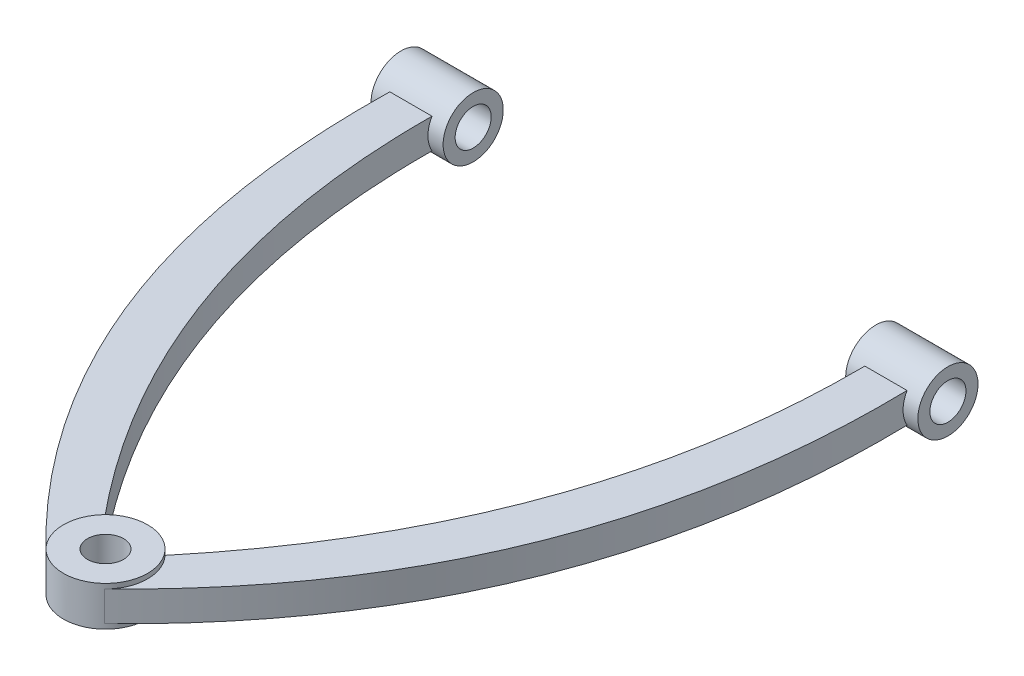
ISO-10303-21;
HEADER;
FILE_DESCRIPTION(('STEP AP214'),'2;1');
FILE_NAME('part.step','',(''),(''),'','','');
FILE_SCHEMA(('AUTOMOTIVE_DESIGN { 1 0 10303 214 1 1 1 1 }'));
ENDSEC;
DATA;
#1=APPLICATION_CONTEXT('core data for automotive mechanical design processes');
#2=APPLICATION_PROTOCOL_DEFINITION('international standard','automotive_design',2000,#1);
#3=PRODUCT_CONTEXT('',#1,'mechanical');
#4=PRODUCT('Part','Part','',(#3));
#5=PRODUCT_RELATED_PRODUCT_CATEGORY('part','',(#4));
#6=PRODUCT_DEFINITION_FORMATION('','',#4);
#7=PRODUCT_DEFINITION_CONTEXT('part definition',#1,'design');
#8=PRODUCT_DEFINITION('design','',#6,#7);
#9=PRODUCT_DEFINITION_SHAPE('','',#8);
#10=(LENGTH_UNIT() NAMED_UNIT(*) SI_UNIT(.MILLI.,.METRE.));
#11=(NAMED_UNIT(*) PLANE_ANGLE_UNIT() SI_UNIT($,.RADIAN.));
#12=(NAMED_UNIT(*) SI_UNIT($,.STERADIAN.) SOLID_ANGLE_UNIT());
#13=UNCERTAINTY_MEASURE_WITH_UNIT(LENGTH_MEASURE(1.E-05),#10,'distance_accuracy_value','');
#14=(GEOMETRIC_REPRESENTATION_CONTEXT(3) GLOBAL_UNCERTAINTY_ASSIGNED_CONTEXT((#13)) GLOBAL_UNIT_ASSIGNED_CONTEXT((#10,
#11,#12)) REPRESENTATION_CONTEXT('',''));
#15=CARTESIAN_POINT('',(0.,0.,0.));
#16=DIRECTION('',(0.,0.,1.));
#17=DIRECTION('',(1.,0.,0.));
#18=AXIS2_PLACEMENT_3D('',#15,#16,#17);
#19=CARTESIAN_POINT('',(85.6927414904811,0.,-95.6897984704443));
#20=DIRECTION('',(0.,1.,0.));
#21=DIRECTION('',(0.,0.,1.));
#22=AXIS2_PLACEMENT_3D('',#19,#20,#21);
#23=PLANE('',#22);
#24=CARTESIAN_POINT('',(0.,0.,0.));
#25=DIRECTION('',(0.,-1.,0.));
#26=DIRECTION('',(0.,0.,-1.));
#27=AXIS2_PLACEMENT_3D('',#24,#25,#26);
#28=CIRCLE('',#27,17.5);
#29=CARTESIAN_POINT('',(-12.1391438354918,0.,12.605204756022));
#30=VERTEX_POINT('',#29);
#31=CARTESIAN_POINT('',(-12.647886897628,0.,-12.094666469763));
#32=VERTEX_POINT('',#31);
#33=EDGE_CURVE('E125',#30,#32,#28,.T.);
#34=ORIENTED_EDGE('',*,*,#33,.F.);
#35=CARTESIAN_POINT('',(-107.423550962357,0.,-229.));
#36=CARTESIAN_POINT('',(-111.604135582139,0.,-83.1821993187942));
#37=CARTESIAN_POINT('',(-12.1391438352886,0.,12.605204755811));
#38=B_SPLINE_CURVE_WITH_KNOTS('',2,(#35,#36,#37),.UNSPECIFIED.,.F.,.F.,(3,3),(0.,1.),.UNSPECIFIED.);
#39=CARTESIAN_POINT('',(-107.505546569178,0.,-225.674682452694));
#40=VERTEX_POINT('',#39);
#41=EDGE_CURVE('E178',#40,#30,#38,.T.);
#42=ORIENTED_EDGE('',*,*,#41,.F.);
#43=DIRECTION('',(1.,0.,0.));
#44=VECTOR('',#43,1.);
#45=CARTESIAN_POINT('',(-113.673550962359,0.,-225.674682452694));
#46=LINE('',#45,#44);
#47=CARTESIAN_POINT('',(-89.965946252667,0.,-225.674682452695));
#48=VERTEX_POINT('',#47);
#49=EDGE_CURVE('E64',#40,#48,#46,.T.);
#50=ORIENTED_EDGE('',*,*,#49,.T.);
#51=CARTESIAN_POINT('',(-12.647886897628,0.,-12.094666469763));
#52=CARTESIAN_POINT('',(-92.0272334008473,0.,-107.676295976017));
#53=CARTESIAN_POINT('',(-89.9235509623574,0.,-229.));
#54=B_SPLINE_CURVE_WITH_KNOTS('',2,(#51,#52,#53),.UNSPECIFIED.,.F.,.F.,(3,3),(0.,1.),.UNSPECIFIED.);
#55=EDGE_CURVE('E133',#32,#48,#54,.T.);
#56=ORIENTED_EDGE('',*,*,#55,.F.);
#57=EDGE_LOOP('',(#34,#42,#50,#56));
#58=FACE_BOUND('',#57,.T.);
#59=ADVANCED_FACE('F41',(#58),#23,.F.);
#60=CARTESIAN_POINT('',(12.6478868978345,0.,-12.0946664699605));
#61=VERTEX_POINT('',#60);
#62=CARTESIAN_POINT('',(12.1391438354918,0.,12.605204756022));
#63=VERTEX_POINT('',#62);
#64=EDGE_CURVE('E114',#61,#63,#28,.T.);
#65=ORIENTED_EDGE('',*,*,#64,.F.);
#66=CARTESIAN_POINT('',(89.9235509623574,0.,-229.));
#67=CARTESIAN_POINT('',(92.0272334008473,0.,-107.676295976017));
#68=CARTESIAN_POINT('',(12.647886897628,0.,-12.094666469763));
#69=B_SPLINE_CURVE_WITH_KNOTS('',2,(#66,#67,#68),.UNSPECIFIED.,.F.,.F.,(3,3),(0.,1.),.UNSPECIFIED.);
#70=CARTESIAN_POINT('',(89.9659462526292,0.,-225.674682452695));
#71=VERTEX_POINT('',#70);
#72=EDGE_CURVE('E117',#71,#61,#69,.T.);
#73=ORIENTED_EDGE('',*,*,#72,.F.);
#74=DIRECTION('',(-1.,0.,0.));
#75=VECTOR('',#74,1.);
#76=CARTESIAN_POINT('',(113.673550962359,0.,-225.674682452694));
#77=LINE('',#76,#75);
#78=CARTESIAN_POINT('',(107.505546569178,0.,-225.674682452694));
#79=VERTEX_POINT('',#78);
#80=EDGE_CURVE('E296',#79,#71,#77,.T.);
#81=ORIENTED_EDGE('',*,*,#80,.F.);
#82=CARTESIAN_POINT('',(12.1391438352886,0.,12.605204755811));
#83=CARTESIAN_POINT('',(111.604135582139,0.,-83.1821993187942));
#84=CARTESIAN_POINT('',(107.423550962357,0.,-229.));
#85=B_SPLINE_CURVE_WITH_KNOTS('',2,(#82,#83,#84),.UNSPECIFIED.,.F.,.F.,(3,3),(0.,1.),.UNSPECIFIED.);
#86=EDGE_CURVE('E119',#63,#79,#85,.T.);
#87=ORIENTED_EDGE('',*,*,#86,.F.);
#88=EDGE_LOOP('',(#65,#73,#81,#87));
#89=FACE_BOUND('',#88,.T.);
#90=ADVANCED_FACE('F116',(#89),#23,.F.);
#91=CARTESIAN_POINT('',(85.6927414904811,12.5,-95.6897984704443));
#92=DIRECTION('',(0.,1.,0.));
#93=DIRECTION('',(0.,0.,1.));
#94=AXIS2_PLACEMENT_3D('',#91,#92,#93);
#95=PLANE('',#94);
#96=CARTESIAN_POINT('',(-107.423550962357,12.5,-229.));
#97=CARTESIAN_POINT('',(-111.604135582139,12.5,-83.1821993187942));
#98=CARTESIAN_POINT('',(-12.1391438352886,12.5,12.605204755811));
#99=B_SPLINE_CURVE_WITH_KNOTS('',2,(#96,#97,#98),.UNSPECIFIED.,.F.,.F.,(3,3),(0.,1.),.UNSPECIFIED.);
#100=CARTESIAN_POINT('',(-107.505546569178,12.5,-225.674682452694));
#101=VERTEX_POINT('',#100);
#102=CARTESIAN_POINT('',(-12.1391438352886,12.5,12.605204755811));
#103=VERTEX_POINT('',#102);
#104=EDGE_CURVE('E195',#101,#103,#99,.T.);
#105=ORIENTED_EDGE('',*,*,#104,.T.);
#106=CARTESIAN_POINT('',(0.,12.5,0.));
#107=DIRECTION('',(0.,1.,0.));
#108=DIRECTION('',(0.,0.,1.));
#109=AXIS2_PLACEMENT_3D('',#106,#107,#108);
#110=CIRCLE('',#109,17.5);
#111=CARTESIAN_POINT('',(-12.647886897628,12.5,-12.094666469763));
#112=VERTEX_POINT('',#111);
#113=EDGE_CURVE('E315',#112,#103,#110,.T.);
#114=ORIENTED_EDGE('',*,*,#113,.F.);
#115=CARTESIAN_POINT('',(-12.647886897628,12.5,-12.094666469763));
#116=CARTESIAN_POINT('',(-92.0272334008473,12.5,-107.676295976017));
#117=CARTESIAN_POINT('',(-89.9235509623574,12.5,-229.));
#118=B_SPLINE_CURVE_WITH_KNOTS('',2,(#115,#116,#117),.UNSPECIFIED.,.F.,.F.,(3,3),(0.,1.),.UNSPECIFIED.);
#119=CARTESIAN_POINT('',(-89.965946252667,12.5,-225.674682452695));
#120=VERTEX_POINT('',#119);
#121=EDGE_CURVE('E186',#112,#120,#118,.T.);
#122=ORIENTED_EDGE('',*,*,#121,.T.);
#123=DIRECTION('',(1.,0.,0.));
#124=VECTOR('',#123,1.);
#125=CARTESIAN_POINT('',(-113.673550962359,12.5,-225.674682452694));
#126=LINE('',#125,#124);
#127=EDGE_CURVE('E220',#101,#120,#126,.T.);
#128=ORIENTED_EDGE('',*,*,#127,.F.);
#129=EDGE_LOOP('',(#105,#114,#122,#128));
#130=FACE_BOUND('',#129,.T.);
#131=ADVANCED_FACE('F251',(#130),#95,.T.);
#132=CARTESIAN_POINT('',(89.9235509623574,12.5,-229.));
#133=CARTESIAN_POINT('',(92.0272334008473,12.5,-107.676295976017));
#134=CARTESIAN_POINT('',(12.647886897628,12.5,-12.094666469763));
#135=B_SPLINE_CURVE_WITH_KNOTS('',2,(#132,#133,#134),.UNSPECIFIED.,.F.,.F.,(3,3),(0.,1.),.UNSPECIFIED.);
#136=CARTESIAN_POINT('',(89.9659462526292,12.5,-225.674682452695));
#137=VERTEX_POINT('',#136);
#138=CARTESIAN_POINT('',(12.647886897628,12.5,-12.094666469763));
#139=VERTEX_POINT('',#138);
#140=EDGE_CURVE('E177',#137,#139,#135,.T.);
#141=ORIENTED_EDGE('',*,*,#140,.T.);
#142=CARTESIAN_POINT('',(12.1391438354918,12.5,12.605204756022));
#143=VERTEX_POINT('',#142);
#144=EDGE_CURVE('E138',#143,#139,#110,.T.);
#145=ORIENTED_EDGE('',*,*,#144,.F.);
#146=CARTESIAN_POINT('',(12.1391438352886,12.5,12.605204755811));
#147=CARTESIAN_POINT('',(111.604135582139,12.5,-83.1821993187942));
#148=CARTESIAN_POINT('',(107.423550962357,12.5,-229.));
#149=B_SPLINE_CURVE_WITH_KNOTS('',2,(#146,#147,#148),.UNSPECIFIED.,.F.,.F.,(3,3),(0.,1.),.UNSPECIFIED.);
#150=CARTESIAN_POINT('',(107.505546569178,12.5,-225.674682452694));
#151=VERTEX_POINT('',#150);
#152=EDGE_CURVE('E173',#143,#151,#149,.T.);
#153=ORIENTED_EDGE('',*,*,#152,.T.);
#154=DIRECTION('',(-1.,0.,0.));
#155=VECTOR('',#154,1.);
#156=CARTESIAN_POINT('',(113.673550962359,12.5,-225.674682452694));
#157=LINE('',#156,#155);
#158=EDGE_CURVE('E171',#151,#137,#157,.T.);
#159=ORIENTED_EDGE('',*,*,#158,.T.);
#160=EDGE_LOOP('',(#141,#145,#153,#159));
#161=FACE_BOUND('',#160,.T.);
#162=ADVANCED_FACE('F313',(#161),#95,.T.);
#163=DIRECTION('',(0.,-1.,0.));
#164=VECTOR('',#163,1.);
#165=SURFACE_OF_LINEAR_EXTRUSION('',#149,#164);
#166=CARTESIAN_POINT('',(107.505546569178,12.5,-225.674682452694));
#167=CARTESIAN_POINT('',(107.507964825297,12.2969562591846,-225.557446464652));
#168=CARTESIAN_POINT('',(107.510215515313,12.0906061898298,-225.445935519193));
#169=CARTESIAN_POINT('',(107.514401803915,11.6719721033634,-225.234693293537));
#170=CARTESIAN_POINT('',(107.516337418488,11.4596883879838,-225.134961415704));
#171=CARTESIAN_POINT('',(107.519913805333,11.0298489424323,-224.947596669373));
#172=CARTESIAN_POINT('',(107.521554583053,10.8122933097617,-224.859963577313));
#173=CARTESIAN_POINT('',(107.524556832573,10.37299382427,-224.697216891252));
#174=CARTESIAN_POINT('',(107.525918802243,10.151258223022,-224.622081026701));
#175=CARTESIAN_POINT('',(107.528383382779,9.70391569747187,-224.484375565102));
#176=CARTESIAN_POINT('',(107.529485996166,9.47830881082054,-224.421805845915));
#177=CARTESIAN_POINT('',(107.531445688203,9.02395230528161,-224.309431072831));
#178=CARTESIAN_POINT('',(107.532302767641,8.79520269651069,-224.259625977853));
#179=CARTESIAN_POINT('',(107.53415361196,8.22009809512333,-224.151235270739));
#180=CARTESIAN_POINT('',(107.53500107589,7.8721855113439,-224.100731961642));
#181=CARTESIAN_POINT('',(107.536196230038,7.17316454798795,-224.029181726582));
#182=CARTESIAN_POINT('',(107.536543622637,6.82205439034098,-224.008152342304));
#183=CARTESIAN_POINT('',(107.536749006514,6.11923019966193,-223.995742602797));
#184=CARTESIAN_POINT('',(107.536606888629,5.767516049417,-224.004368860943));
#185=CARTESIAN_POINT('',(107.53582857243,5.06624552335914,-224.051219949945));
#186=CARTESIAN_POINT('',(107.535192658549,4.71668802209106,-224.089427741537));
#187=CARTESIAN_POINT('',(107.533643091171,4.11397005021162,-224.181145751766));
#188=CARTESIAN_POINT('',(107.532847368279,3.85976478122788,-224.227936621));
#189=CARTESIAN_POINT('',(107.53096432554,3.35470336386868,-224.337187627148));
#190=CARTESIAN_POINT('',(107.529876975457,3.1038475656178,-224.399649388862));
#191=CARTESIAN_POINT('',(107.527393586931,2.60647840473594,-224.540003012399));
#192=CARTESIAN_POINT('',(107.525997528668,2.35996532202042,-224.61789586492));
#193=CARTESIAN_POINT('',(107.522871799696,1.87158888514297,-224.789037258032));
#194=CARTESIAN_POINT('',(107.521141247126,1.62973972265556,-224.882326291923));
#195=CARTESIAN_POINT('',(107.517325072163,1.15231414462602,-225.083752570706));
#196=CARTESIAN_POINT('',(107.515239456019,0.916737618764771,-225.191889554255));
#197=CARTESIAN_POINT('',(107.510686235949,0.452761198267277,-225.422580668353));
#198=CARTESIAN_POINT('',(107.508218637834,0.224361194497424,-225.545134579529));
#199=CARTESIAN_POINT('',(107.505546569178,0.,-225.674682452694));
#200=B_SPLINE_CURVE_WITH_KNOTS('',3,(#166,#167,#168,#169,#170,#171,#172,#173,#174,#175,#176,
#177,#178,#179,#180,#181,#182,#183,#184,#185,#186,#187,#188,#189,#190,#191,#192,#193,#194,#195,
#196,#197,#198,#199),.UNSPECIFIED.,.F.,.F.,(4,2,2,2,2,2,2,2,2,2,2,2,2,2,2,2,4),(0.,
0.703320128807843,1.40660455789938,2.10987599004741,2.8118804166254,3.51387801962346,
4.21587336336613,5.26923041895855,6.32321412419676,7.3774328890199,8.43104486446943,
9.20601116063836,9.98105784065998,10.7561542958891,11.533322795861,12.3104776184485,
13.0876206170915),.UNSPECIFIED.);
#201=EDGE_CURVE('E71',#151,#79,#200,.T.);
#202=ORIENTED_EDGE('',*,*,#201,.F.);
#203=ORIENTED_EDGE('',*,*,#152,.F.);
#204=DIRECTION('',(0.,-1.,0.));
#205=VECTOR('',#204,1.);
#206=CARTESIAN_POINT('',(12.1391438352886,12.5,12.605204755811));
#207=LINE('',#206,#205);
#208=EDGE_CURVE('E269',#143,#63,#207,.T.);
#209=ORIENTED_EDGE('',*,*,#208,.T.);
#210=ORIENTED_EDGE('',*,*,#86,.T.);
#211=EDGE_LOOP('',(#202,#203,#209,#210));
#212=FACE_BOUND('',#211,.T.);
#213=ADVANCED_FACE('F43',(#212),#165,.F.);
#214=DIRECTION('',(0.,-1.,0.));
#215=VECTOR('',#214,1.);
#216=SURFACE_OF_LINEAR_EXTRUSION('',#135,#215);
#217=CARTESIAN_POINT('',(89.9659462526292,0.,-225.674682452695));
#218=CARTESIAN_POINT('',(89.9669009833128,0.20307999542465,-225.557425545088));
#219=CARTESIAN_POINT('',(89.9677525743862,0.409466345903485,-225.44589636073));
#220=CARTESIAN_POINT('',(89.9692774710928,0.828172876852886,-225.234622692603));
#221=CARTESIAN_POINT('',(89.9699507857823,1.04049275529671,-225.134877610349));
#222=CARTESIAN_POINT('',(89.9711472037706,1.47040426348429,-224.947491150139));
#223=CARTESIAN_POINT('',(89.971670309844,1.68799579576561,-224.859849548613));
#224=CARTESIAN_POINT('',(89.9725905397072,2.12736687845747,-224.697090183931));
#225=CARTESIAN_POINT('',(89.9729878886298,2.34913818305194,-224.621950155963));
#226=CARTESIAN_POINT('',(89.9736800987121,2.79655164177993,-224.484240565323));
#227=CARTESIAN_POINT('',(89.9739749608671,3.02219375829928,-224.421670880575));
#228=CARTESIAN_POINT('',(89.97448102943,3.47662014550133,-224.309300184614));
#229=CARTESIAN_POINT('',(89.9746922361077,3.70540440604247,-224.259499132199));
#230=CARTESIAN_POINT('',(89.9751354274091,4.28059478872149,-224.151123357795));
#231=CARTESIAN_POINT('',(89.9753249005555,4.62855808516864,-224.100633347311));
#232=CARTESIAN_POINT('',(89.9755870317228,5.3276786435772,-224.029117990893));
#233=CARTESIAN_POINT('',(89.9756596201808,5.67883768253962,-224.008110191964));
#234=CARTESIAN_POINT('',(89.9757027585955,6.38175708004542,-223.995751645468));
#235=CARTESIAN_POINT('',(89.9756732858887,6.73351755480768,-224.004407484963));
#236=CARTESIAN_POINT('',(89.975506169149,7.43487812810924,-224.051325520132));
#237=CARTESIAN_POINT('',(89.975368587398,7.78447935375872,-224.089570669134));
#238=CARTESIAN_POINT('',(89.9750121273788,8.38716535565968,-224.181344172519));
#239=CARTESIAN_POINT('',(89.974824418925,8.6412966320127,-224.22814488226));
#240=CARTESIAN_POINT('',(89.9743575346984,9.14621148362891,-224.337406936439));
#241=CARTESIAN_POINT('',(89.9740783494825,9.39699471049606,-224.399869897508));
#242=CARTESIAN_POINT('',(89.9734053464492,9.89422129241764,-224.540217691955));
#243=CARTESIAN_POINT('',(89.973011521301,10.1406643688732,-224.618103511444));
#244=CARTESIAN_POINT('',(89.9720796701388,10.6289030128067,-224.789222714447));
#245=CARTESIAN_POINT('',(89.9715412622096,10.870684426887,-224.882496489869));
#246=CARTESIAN_POINT('',(89.9702879538812,11.3479793745455,-225.083885168331));
#247=CARTESIAN_POINT('',(89.9695730565619,11.5834930174257,-225.191999812362));
#248=CARTESIAN_POINT('',(89.9679293965655,12.0473495210904,-225.422640141811));
#249=CARTESIAN_POINT('',(89.9670006370705,12.2756924885097,-225.545165612797));
#250=CARTESIAN_POINT('',(89.9659462526292,12.5,-225.674682452695));
#251=B_SPLINE_CURVE_WITH_KNOTS('',3,(#217,#218,#219,#220,#221,#222,#223,#224,#225,#226,#227,
#228,#229,#230,#231,#232,#233,#234,#235,#236,#237,#238,#239,#240,#241,#242,#243,#244,#245,#246,
#247,#248,#249,#250),.UNSPECIFIED.,.F.,.F.,(4,2,2,2,2,2,2,2,2,2,2,2,2,2,2,2,4),(0.,
0.703414089433528,1.40679243886748,2.11015779413728,2.81225675406938,3.51434889529558,
4.2164387709877,5.2699375686087,6.32406311434618,7.37842275276861,8.43217541692941,
9.20692584514345,9.98175627470783,10.7566362615021,11.5335835769809,12.3105173345942,
13.0874395330001),.UNSPECIFIED.);
#252=EDGE_CURVE('E57',#71,#137,#251,.T.);
#253=ORIENTED_EDGE('',*,*,#252,.F.);
#254=ORIENTED_EDGE('',*,*,#72,.T.);
#255=DIRECTION('',(0.,-1.,0.));
#256=VECTOR('',#255,1.);
#257=CARTESIAN_POINT('',(12.647886897628,12.5,-12.094666469763));
#258=LINE('',#257,#256);
#259=EDGE_CURVE('E130',#139,#61,#258,.T.);
#260=ORIENTED_EDGE('',*,*,#259,.F.);
#261=ORIENTED_EDGE('',*,*,#140,.F.);
#262=EDGE_LOOP('',(#253,#254,#260,#261));
#263=FACE_BOUND('',#262,.T.);
#264=ADVANCED_FACE('F129',(#263),#216,.F.);
#265=DIRECTION('',(0.,-1.,0.));
#266=VECTOR('',#265,1.);
#267=SURFACE_OF_LINEAR_EXTRUSION('',#118,#266);
#268=ORIENTED_EDGE('',*,*,#55,.T.);
#269=CARTESIAN_POINT('',(-89.9659462526292,0.,-225.674682452695));
#270=CARTESIAN_POINT('',(-89.9669009833128,0.20307999542465,-225.557425545088));
#271=CARTESIAN_POINT('',(-89.9677525743862,0.409466345903485,-225.44589636073));
#272=CARTESIAN_POINT('',(-89.9692774710928,0.828172876852887,-225.234622692603));
#273=CARTESIAN_POINT('',(-89.9699507857823,1.04049275529671,-225.134877610349));
#274=CARTESIAN_POINT('',(-89.9711472037706,1.47040426348429,-224.947491150139));
#275=CARTESIAN_POINT('',(-89.971670309844,1.68799579576561,-224.859849548613));
#276=CARTESIAN_POINT('',(-89.9725905397072,2.12736687845747,-224.697090183931));
#277=CARTESIAN_POINT('',(-89.9729878886298,2.34913818305194,-224.621950155963));
#278=CARTESIAN_POINT('',(-89.9736800987121,2.79655164177993,-224.484240565323));
#279=CARTESIAN_POINT('',(-89.9739749608672,3.02219375829928,-224.421670880575));
#280=CARTESIAN_POINT('',(-89.97448102943,3.47662014550133,-224.309300184614));
#281=CARTESIAN_POINT('',(-89.9746922361077,3.70540440604247,-224.259499132199));
#282=CARTESIAN_POINT('',(-89.975135427409,4.2805947887215,-224.151123357795));
#283=CARTESIAN_POINT('',(-89.9753249005555,4.62855808516864,-224.100633347311));
#284=CARTESIAN_POINT('',(-89.9755870317228,5.3276786435772,-224.029117990893));
#285=CARTESIAN_POINT('',(-89.9756596201808,5.67883768253962,-224.008110191964));
#286=CARTESIAN_POINT('',(-89.9757027585955,6.38175708004542,-223.995751645468));
#287=CARTESIAN_POINT('',(-89.9756732858887,6.73351755480768,-224.004407484963));
#288=CARTESIAN_POINT('',(-89.975506169149,7.43487812810924,-224.051325520132));
#289=CARTESIAN_POINT('',(-89.9753685873979,7.78447935375872,-224.089570669134));
#290=CARTESIAN_POINT('',(-89.9750121273788,8.38716535565968,-224.181344172519));
#291=CARTESIAN_POINT('',(-89.974824418925,8.6412966320127,-224.22814488226));
#292=CARTESIAN_POINT('',(-89.9743575346984,9.14621148362891,-224.337406936439));
#293=CARTESIAN_POINT('',(-89.9740783494825,9.39699471049606,-224.399869897508));
#294=CARTESIAN_POINT('',(-89.9734053464492,9.89422129241765,-224.540217691955));
#295=CARTESIAN_POINT('',(-89.973011521301,10.1406643688732,-224.618103511444));
#296=CARTESIAN_POINT('',(-89.9720796701388,10.6289030128067,-224.789222714447));
#297=CARTESIAN_POINT('',(-89.9715412622097,10.870684426887,-224.882496489869));
#298=CARTESIAN_POINT('',(-89.9702879538812,11.3479793745455,-225.083885168331));
#299=CARTESIAN_POINT('',(-89.9695730565619,11.5834930174256,-225.191999812362));
#300=CARTESIAN_POINT('',(-89.9679293965655,12.0473495210904,-225.42264014181));
#301=CARTESIAN_POINT('',(-89.9670006370704,12.2756924885096,-225.545165612797));
#302=CARTESIAN_POINT('',(-89.9659462526292,12.5,-225.674682452695));
#303=B_SPLINE_CURVE_WITH_KNOTS('',3,(#269,#270,#271,#272,#273,#274,#275,#276,#277,#278,#279,
#280,#281,#282,#283,#284,#285,#286,#287,#288,#289,#290,#291,#292,#293,#294,#295,#296,#297,#298,
#299,#300,#301,#302),.UNSPECIFIED.,.F.,.F.,(4,2,2,2,2,2,2,2,2,2,2,2,2,2,2,2,4),(0.,
0.703414089433529,1.40679243886748,2.11015779413728,2.81225675406938,3.51434889529557,
4.2164387709877,5.2699375686087,6.32406311434618,7.37842275276861,8.43217541692941,
9.20692584514345,9.98175627470782,10.7566362615021,11.5335835769809,12.3105173345942,
13.087439533),.UNSPECIFIED.);
#304=EDGE_CURVE('E211',#48,#120,#303,.T.);
#305=ORIENTED_EDGE('',*,*,#304,.T.);
#306=ORIENTED_EDGE('',*,*,#121,.F.);
#307=DIRECTION('',(0.,-1.,0.));
#308=VECTOR('',#307,1.);
#309=CARTESIAN_POINT('',(-12.647886897628,12.5,-12.094666469763));
#310=LINE('',#309,#308);
#311=EDGE_CURVE('E139',#112,#32,#310,.T.);
#312=ORIENTED_EDGE('',*,*,#311,.T.);
#313=EDGE_LOOP('',(#268,#305,#306,#312));
#314=FACE_BOUND('',#313,.T.);
#315=ADVANCED_FACE('F203',(#314),#267,.F.);
#316=DIRECTION('',(0.,-1.,0.));
#317=VECTOR('',#316,1.);
#318=SURFACE_OF_LINEAR_EXTRUSION('',#99,#317);
#319=ORIENTED_EDGE('',*,*,#104,.F.);
#320=CARTESIAN_POINT('',(-107.505546569178,12.5,-225.674682452694));
#321=CARTESIAN_POINT('',(-107.507964825297,12.2969562591846,-225.557446464652));
#322=CARTESIAN_POINT('',(-107.510215515313,12.0906061898298,-225.445935519193));
#323=CARTESIAN_POINT('',(-107.514401803915,11.6719721033634,-225.234693293537));
#324=CARTESIAN_POINT('',(-107.516337418488,11.4596883879838,-225.134961415704));
#325=CARTESIAN_POINT('',(-107.519913805333,11.0298489424323,-224.947596669373));
#326=CARTESIAN_POINT('',(-107.521554583053,10.8122933097617,-224.859963577313));
#327=CARTESIAN_POINT('',(-107.524556832573,10.37299382427,-224.697216891252));
#328=CARTESIAN_POINT('',(-107.525918802243,10.151258223022,-224.622081026701));
#329=CARTESIAN_POINT('',(-107.528383382779,9.70391569747187,-224.484375565102));
#330=CARTESIAN_POINT('',(-107.529485996167,9.47830881082054,-224.421805845915));
#331=CARTESIAN_POINT('',(-107.531445688203,9.02395230528161,-224.309431072831));
#332=CARTESIAN_POINT('',(-107.532302767641,8.79520269651069,-224.259625977853));
#333=CARTESIAN_POINT('',(-107.53415361196,8.22009809512333,-224.151235270739));
#334=CARTESIAN_POINT('',(-107.53500107589,7.8721855113439,-224.100731961642));
#335=CARTESIAN_POINT('',(-107.536196230038,7.17316454798795,-224.029181726582));
#336=CARTESIAN_POINT('',(-107.536543622637,6.82205439034097,-224.008152342304));
#337=CARTESIAN_POINT('',(-107.536749006514,6.11923019966193,-223.995742602797));
#338=CARTESIAN_POINT('',(-107.536606888629,5.767516049417,-224.004368860943));
#339=CARTESIAN_POINT('',(-107.53582857243,5.06624552335914,-224.051219949945));
#340=CARTESIAN_POINT('',(-107.535192658549,4.71668802209105,-224.089427741537));
#341=CARTESIAN_POINT('',(-107.533643091171,4.11397005021162,-224.181145751766));
#342=CARTESIAN_POINT('',(-107.532847368279,3.85976478122788,-224.227936621));
#343=CARTESIAN_POINT('',(-107.53096432554,3.35470336386868,-224.337187627148));
#344=CARTESIAN_POINT('',(-107.529876975457,3.10384756561779,-224.399649388862));
#345=CARTESIAN_POINT('',(-107.527393586931,2.60647840473594,-224.540003012399));
#346=CARTESIAN_POINT('',(-107.525997528668,2.35996532202041,-224.61789586492));
#347=CARTESIAN_POINT('',(-107.522871799696,1.87158888514297,-224.789037258032));
#348=CARTESIAN_POINT('',(-107.521141247126,1.62973972265555,-224.882326291923));
#349=CARTESIAN_POINT('',(-107.517325072163,1.15231414462601,-225.083752570706));
#350=CARTESIAN_POINT('',(-107.515239456019,0.916737618764757,-225.191889554255));
#351=CARTESIAN_POINT('',(-107.510686235949,0.452761198267263,-225.422580668353));
#352=CARTESIAN_POINT('',(-107.508218637834,0.224361194497413,-225.545134579529));
#353=CARTESIAN_POINT('',(-107.505546569178,0.,-225.674682452694));
#354=B_SPLINE_CURVE_WITH_KNOTS('',3,(#320,#321,#322,#323,#324,#325,#326,#327,#328,#329,#330,
#331,#332,#333,#334,#335,#336,#337,#338,#339,#340,#341,#342,#343,#344,#345,#346,#347,#348,#349,
#350,#351,#352,#353),.UNSPECIFIED.,.F.,.F.,(4,2,2,2,2,2,2,2,2,2,2,2,2,2,2,2,4),(0.,
0.70332012880785,1.40660455789937,2.10987599004742,2.81188041662541,3.51387801962346,
4.21587336336613,5.26923041895855,6.32321412419676,7.37743288901991,8.43104486446943,
9.20601116063838,9.98105784065999,10.7561542958891,11.533322795861,12.3104776184485,
13.0876206170915),.UNSPECIFIED.);
#355=EDGE_CURVE('E11',#101,#40,#354,.T.);
#356=ORIENTED_EDGE('',*,*,#355,.T.);
#357=ORIENTED_EDGE('',*,*,#41,.T.);
#358=DIRECTION('',(0.,-1.,0.));
#359=VECTOR('',#358,1.);
#360=CARTESIAN_POINT('',(-12.1391438352886,12.5,12.605204755811));
#361=LINE('',#360,#359);
#362=EDGE_CURVE('E142',#103,#30,#361,.T.);
#363=ORIENTED_EDGE('',*,*,#362,.F.);
#364=EDGE_LOOP('',(#319,#356,#357,#363));
#365=FACE_BOUND('',#364,.T.);
#366=ADVANCED_FACE('F206',(#365),#318,.F.);
#367=CARTESIAN_POINT('',(0.,12.5,0.));
#368=DIRECTION('',(0.,-1.,0.));
#369=DIRECTION('',(0.,0.,-1.));
#370=AXIS2_PLACEMENT_3D('',#367,#368,#369);
#371=CYLINDRICAL_SURFACE('',#370,17.499999999707);
#372=ORIENTED_EDGE('',*,*,#64,.T.);
#373=ORIENTED_EDGE('',*,*,#208,.F.);
#374=ORIENTED_EDGE('',*,*,#144,.T.);
#375=ORIENTED_EDGE('',*,*,#259,.T.);
#376=EDGE_LOOP('',(#372,#373,#374,#375));
#377=FACE_BOUND('',#376,.T.);
#378=ORIENTED_EDGE('',*,*,#362,.T.);
#379=ORIENTED_EDGE('',*,*,#33,.T.);
#380=ORIENTED_EDGE('',*,*,#311,.F.);
#381=ORIENTED_EDGE('',*,*,#113,.T.);
#382=EDGE_LOOP('',(#378,#379,#380,#381));
#383=FACE_BOUND('',#382,.T.);
#384=CARTESIAN_POINT('',(0.,14.5,0.));
#385=DIRECTION('',(0.,1.,0.));
#386=DIRECTION('',(0.,0.,1.));
#387=AXIS2_PLACEMENT_3D('',#384,#385,#386);
#388=CIRCLE('',#387,17.5);
#389=CARTESIAN_POINT('',(0.,14.5,17.5));
#390=VERTEX_POINT('',#389);
#391=EDGE_CURVE('E314',#390,#390,#388,.T.);
#392=ORIENTED_EDGE('',*,*,#391,.F.);
#393=EDGE_LOOP('',(#392));
#394=FACE_BOUND('',#393,.T.);
#395=CARTESIAN_POINT('',(0.,-2.,0.));
#396=DIRECTION('',(0.,-1.,0.));
#397=DIRECTION('',(0.,0.,-1.));
#398=AXIS2_PLACEMENT_3D('',#395,#396,#397);
#399=CIRCLE('',#398,17.5);
#400=CARTESIAN_POINT('',(0.,-2.,-17.5));
#401=VERTEX_POINT('',#400);
#402=EDGE_CURVE('E124',#401,#401,#399,.T.);
#403=ORIENTED_EDGE('',*,*,#402,.F.);
#404=EDGE_LOOP('',(#403));
#405=FACE_BOUND('',#404,.T.);
#406=ADVANCED_FACE('F135',(#377,#383,#394,#405),#371,.T.);
#407=CARTESIAN_POINT('',(0.,12.5,0.));
#408=DIRECTION('',(0.,-1.,0.));
#409=DIRECTION('',(0.,0.,-1.));
#410=AXIS2_PLACEMENT_3D('',#407,#408,#409);
#411=CYLINDRICAL_SURFACE('',#410,7.5);
#412=CARTESIAN_POINT('',(0.,14.5,0.));
#413=DIRECTION('',(0.,1.,0.));
#414=DIRECTION('',(0.,0.,1.));
#415=AXIS2_PLACEMENT_3D('',#412,#413,#414);
#416=CIRCLE('',#415,7.5);
#417=CARTESIAN_POINT('',(0.,14.5,7.5));
#418=VERTEX_POINT('',#417);
#419=EDGE_CURVE('E320',#418,#418,#416,.T.);
#420=ORIENTED_EDGE('',*,*,#419,.T.);
#421=EDGE_LOOP('',(#420));
#422=FACE_BOUND('',#421,.T.);
#423=CARTESIAN_POINT('',(0.,-2.,0.));
#424=DIRECTION('',(0.,-1.,0.));
#425=DIRECTION('',(0.,0.,-1.));
#426=AXIS2_PLACEMENT_3D('',#423,#424,#425);
#427=CIRCLE('',#426,7.5);
#428=CARTESIAN_POINT('',(0.,-2.,-7.5));
#429=VERTEX_POINT('',#428);
#430=EDGE_CURVE('E337',#429,#429,#427,.T.);
#431=ORIENTED_EDGE('',*,*,#430,.T.);
#432=EDGE_LOOP('',(#431));
#433=FACE_BOUND('',#432,.T.);
#434=ADVANCED_FACE('F159',(#422,#433),#411,.F.);
#435=CARTESIAN_POINT('',(113.673550962359,6.25000000000002,-236.5));
#436=DIRECTION('',(-1.,0.,0.));
#437=DIRECTION('',(0.,0.,1.));
#438=AXIS2_PLACEMENT_3D('',#435,#436,#437);
#439=CYLINDRICAL_SURFACE('',#438,12.5);
#440=CARTESIAN_POINT('',(113.673550962359,6.25000000000002,-236.5));
#441=DIRECTION('',(1.,0.,0.));
#442=DIRECTION('',(0.,0.,-1.));
#443=AXIS2_PLACEMENT_3D('',#440,#441,#442);
#444=CIRCLE('',#443,12.5);
#445=CARTESIAN_POINT('',(113.673550962359,6.25000000000002,-249.));
#446=VERTEX_POINT('',#445);
#447=EDGE_CURVE('E299',#446,#446,#444,.T.);
#448=ORIENTED_EDGE('',*,*,#447,.F.);
#449=EDGE_LOOP('',(#448));
#450=FACE_BOUND('',#449,.T.);
#451=CARTESIAN_POINT('',(83.6735509623592,6.25000000000002,-236.5));
#452=DIRECTION('',(1.,0.,0.));
#453=DIRECTION('',(0.,0.,-1.));
#454=AXIS2_PLACEMENT_3D('',#451,#452,#453);
#455=CIRCLE('',#454,12.5);
#456=CARTESIAN_POINT('',(83.6735509623593,6.25000000000002,-249.));
#457=VERTEX_POINT('',#456);
#458=EDGE_CURVE('E300',#457,#457,#455,.T.);
#459=ORIENTED_EDGE('',*,*,#458,.T.);
#460=EDGE_LOOP('',(#459));
#461=FACE_BOUND('',#460,.T.);
#462=ORIENTED_EDGE('',*,*,#158,.F.);
#463=ORIENTED_EDGE('',*,*,#201,.T.);
#464=ORIENTED_EDGE('',*,*,#80,.T.);
#465=ORIENTED_EDGE('',*,*,#252,.T.);
#466=EDGE_LOOP('',(#462,#463,#464,#465));
#467=FACE_BOUND('',#466,.T.);
#468=ADVANCED_FACE('F153',(#450,#461,#467),#439,.T.);
#469=CARTESIAN_POINT('',(113.673550962359,6.25000000000002,-236.5));
#470=DIRECTION('',(1.,0.,0.));
#471=DIRECTION('',(0.,0.,-1.));
#472=AXIS2_PLACEMENT_3D('',#469,#470,#471);
#473=PLANE('',#472);
#474=ORIENTED_EDGE('',*,*,#447,.T.);
#475=EDGE_LOOP('',(#474));
#476=FACE_BOUND('',#475,.T.);
#477=CARTESIAN_POINT('',(113.673550962359,6.25000000000002,-236.5));
#478=DIRECTION('',(1.,0.,0.));
#479=DIRECTION('',(0.,0.,-1.));
#480=AXIS2_PLACEMENT_3D('',#477,#478,#479);
#481=CIRCLE('',#480,7.50000000000001);
#482=CARTESIAN_POINT('',(113.673550962359,6.25000000000002,-244.));
#483=VERTEX_POINT('',#482);
#484=EDGE_CURVE('E222',#483,#483,#481,.T.);
#485=ORIENTED_EDGE('',*,*,#484,.F.);
#486=EDGE_LOOP('',(#485));
#487=FACE_BOUND('',#486,.T.);
#488=ADVANCED_FACE('F158',(#476,#487),#473,.T.);
#489=CARTESIAN_POINT('',(83.6735509623592,6.25000000000002,-236.5));
#490=DIRECTION('',(1.,0.,0.));
#491=DIRECTION('',(0.,0.,-1.));
#492=AXIS2_PLACEMENT_3D('',#489,#490,#491);
#493=PLANE('',#492);
#494=ORIENTED_EDGE('',*,*,#458,.F.);
#495=EDGE_LOOP('',(#494));
#496=FACE_BOUND('',#495,.T.);
#497=CARTESIAN_POINT('',(83.6735509623592,6.25000000000002,-236.5));
#498=DIRECTION('',(1.,0.,0.));
#499=DIRECTION('',(0.,0.,-1.));
#500=AXIS2_PLACEMENT_3D('',#497,#498,#499);
#501=CIRCLE('',#500,7.50000000000001);
#502=CARTESIAN_POINT('',(83.6735509623593,6.25000000000002,-244.));
#503=VERTEX_POINT('',#502);
#504=EDGE_CURVE('E219',#503,#503,#501,.T.);
#505=ORIENTED_EDGE('',*,*,#504,.T.);
#506=EDGE_LOOP('',(#505));
#507=FACE_BOUND('',#506,.T.);
#508=ADVANCED_FACE('F161',(#496,#507),#493,.F.);
#509=CARTESIAN_POINT('',(113.673550962359,6.25000000000002,-236.5));
#510=DIRECTION('',(-1.,0.,0.));
#511=DIRECTION('',(0.,0.,1.));
#512=AXIS2_PLACEMENT_3D('',#509,#510,#511);
#513=CYLINDRICAL_SURFACE('',#512,7.50000000000001);
#514=ORIENTED_EDGE('',*,*,#484,.T.);
#515=EDGE_LOOP('',(#514));
#516=FACE_BOUND('',#515,.T.);
#517=ORIENTED_EDGE('',*,*,#504,.F.);
#518=EDGE_LOOP('',(#517));
#519=FACE_BOUND('',#518,.T.);
#520=ADVANCED_FACE('F230',(#516,#519),#513,.F.);
#521=CARTESIAN_POINT('',(-113.673550962359,6.25000000000002,-236.5));
#522=DIRECTION('',(1.,0.,0.));
#523=DIRECTION('',(0.,0.,-1.));
#524=AXIS2_PLACEMENT_3D('',#521,#522,#523);
#525=CYLINDRICAL_SURFACE('',#524,12.5);
#526=CARTESIAN_POINT('',(-83.6735509623592,6.25000000000002,-236.5));
#527=DIRECTION('',(1.,0.,0.));
#528=DIRECTION('',(0.,0.,-1.));
#529=AXIS2_PLACEMENT_3D('',#526,#527,#528);
#530=CIRCLE('',#529,12.5);
#531=CARTESIAN_POINT('',(-83.6735509623593,6.25000000000002,-249.));
#532=VERTEX_POINT('',#531);
#533=EDGE_CURVE('E326',#532,#532,#530,.T.);
#534=ORIENTED_EDGE('',*,*,#533,.F.);
#535=EDGE_LOOP('',(#534));
#536=FACE_BOUND('',#535,.T.);
#537=CARTESIAN_POINT('',(-113.673550962359,6.25000000000002,-236.5));
#538=DIRECTION('',(1.,0.,0.));
#539=DIRECTION('',(0.,0.,-1.));
#540=AXIS2_PLACEMENT_3D('',#537,#538,#539);
#541=CIRCLE('',#540,12.5);
#542=CARTESIAN_POINT('',(-113.673550962359,6.25000000000002,-249.));
#543=VERTEX_POINT('',#542);
#544=EDGE_CURVE('E329',#543,#543,#541,.T.);
#545=ORIENTED_EDGE('',*,*,#544,.T.);
#546=EDGE_LOOP('',(#545));
#547=FACE_BOUND('',#546,.T.);
#548=ORIENTED_EDGE('',*,*,#304,.F.);
#549=ORIENTED_EDGE('',*,*,#49,.F.);
#550=ORIENTED_EDGE('',*,*,#355,.F.);
#551=ORIENTED_EDGE('',*,*,#127,.T.);
#552=EDGE_LOOP('',(#548,#549,#550,#551));
#553=FACE_BOUND('',#552,.T.);
#554=ADVANCED_FACE('F224',(#536,#547,#553),#525,.T.);
#555=CARTESIAN_POINT('',(-113.673550962359,6.25000000000002,-236.5));
#556=DIRECTION('',(-1.,0.,0.));
#557=DIRECTION('',(0.,0.,-1.));
#558=AXIS2_PLACEMENT_3D('',#555,#556,#557);
#559=PLANE('',#558);
#560=CARTESIAN_POINT('',(-113.673550962359,6.25000000000002,-236.5));
#561=DIRECTION('',(1.,0.,0.));
#562=DIRECTION('',(0.,0.,-1.));
#563=AXIS2_PLACEMENT_3D('',#560,#561,#562);
#564=CIRCLE('',#563,7.50000000000001);
#565=CARTESIAN_POINT('',(-113.673550962359,6.25000000000002,-244.));
#566=VERTEX_POINT('',#565);
#567=EDGE_CURVE('E323',#566,#566,#564,.T.);
#568=ORIENTED_EDGE('',*,*,#567,.T.);
#569=EDGE_LOOP('',(#568));
#570=FACE_BOUND('',#569,.T.);
#571=ORIENTED_EDGE('',*,*,#544,.F.);
#572=EDGE_LOOP('',(#571));
#573=FACE_BOUND('',#572,.T.);
#574=ADVANCED_FACE('F229',(#570,#573),#559,.T.);
#575=CARTESIAN_POINT('',(-83.6735509623592,6.25000000000002,-236.5));
#576=DIRECTION('',(-1.,0.,0.));
#577=DIRECTION('',(0.,0.,-1.));
#578=AXIS2_PLACEMENT_3D('',#575,#576,#577);
#579=PLANE('',#578);
#580=CARTESIAN_POINT('',(-83.6735509623592,6.25000000000002,-236.5));
#581=DIRECTION('',(1.,0.,0.));
#582=DIRECTION('',(0.,0.,-1.));
#583=AXIS2_PLACEMENT_3D('',#580,#581,#582);
#584=CIRCLE('',#583,7.50000000000001);
#585=CARTESIAN_POINT('',(-83.6735509623593,6.25000000000002,-244.));
#586=VERTEX_POINT('',#585);
#587=EDGE_CURVE('E318',#586,#586,#584,.T.);
#588=ORIENTED_EDGE('',*,*,#587,.F.);
#589=EDGE_LOOP('',(#588));
#590=FACE_BOUND('',#589,.T.);
#591=ORIENTED_EDGE('',*,*,#533,.T.);
#592=EDGE_LOOP('',(#591));
#593=FACE_BOUND('',#592,.T.);
#594=ADVANCED_FACE('F232',(#590,#593),#579,.F.);
#595=CARTESIAN_POINT('',(-113.673550962359,6.25000000000002,-236.5));
#596=DIRECTION('',(1.,0.,0.));
#597=DIRECTION('',(0.,0.,-1.));
#598=AXIS2_PLACEMENT_3D('',#595,#596,#597);
#599=CYLINDRICAL_SURFACE('',#598,7.50000000000001);
#600=ORIENTED_EDGE('',*,*,#567,.F.);
#601=EDGE_LOOP('',(#600));
#602=FACE_BOUND('',#601,.T.);
#603=ORIENTED_EDGE('',*,*,#587,.T.);
#604=EDGE_LOOP('',(#603));
#605=FACE_BOUND('',#604,.T.);
#606=ADVANCED_FACE('F357',(#602,#605),#599,.F.);
#607=CARTESIAN_POINT('',(0.,14.5,0.));
#608=DIRECTION('',(0.,1.,0.));
#609=DIRECTION('',(0.,0.,1.));
#610=AXIS2_PLACEMENT_3D('',#607,#608,#609);
#611=PLANE('',#610);
#612=ORIENTED_EDGE('',*,*,#391,.T.);
#613=EDGE_LOOP('',(#612));
#614=FACE_BOUND('',#613,.T.);
#615=ORIENTED_EDGE('',*,*,#419,.F.);
#616=EDGE_LOOP('',(#615));
#617=FACE_BOUND('',#616,.T.);
#618=ADVANCED_FACE('F350',(#614,#617),#611,.T.);
#619=CARTESIAN_POINT('',(0.,-2.,0.));
#620=DIRECTION('',(0.,-1.,0.));
#621=DIRECTION('',(0.,0.,-1.));
#622=AXIS2_PLACEMENT_3D('',#619,#620,#621);
#623=PLANE('',#622);
#624=ORIENTED_EDGE('',*,*,#402,.T.);
#625=EDGE_LOOP('',(#624));
#626=FACE_BOUND('',#625,.T.);
#627=ORIENTED_EDGE('',*,*,#430,.F.);
#628=EDGE_LOOP('',(#627));
#629=FACE_BOUND('',#628,.T.);
#630=ADVANCED_FACE('F346',(#626,#629),#623,.T.);
#631=CLOSED_SHELL('',(#59,#90,#131,#162,#213,#264,#315,#366,#406,#434,#468,#488,#508,#520,#554,
#574,#594,#606,#618,#630));
#632=MANIFOLD_SOLID_BREP('B2',#631);
#633=ADVANCED_BREP_SHAPE_REPRESENTATION('',(#18,#632),#14);
#634=SHAPE_DEFINITION_REPRESENTATION(#9,#633);
ENDSEC;
END-ISO-10303-21;
